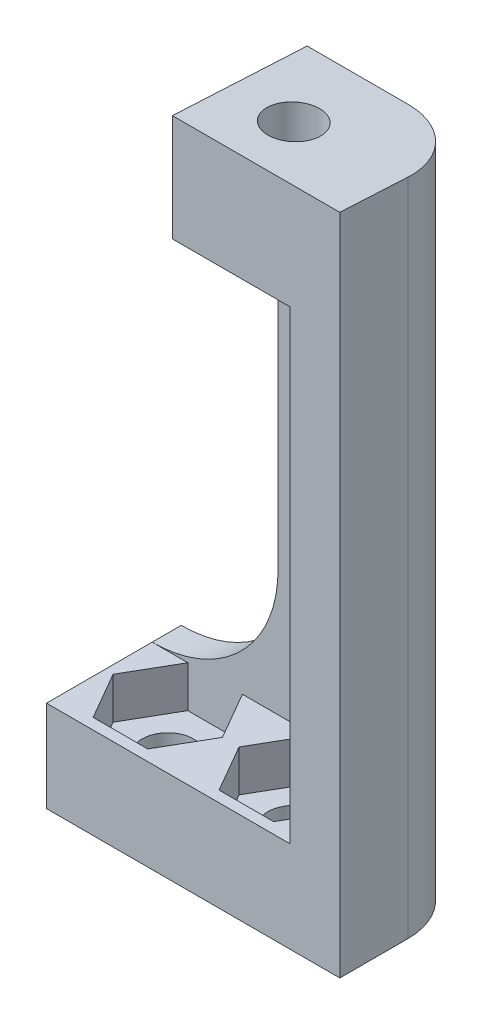
ISO-10303-21;
HEADER;
FILE_DESCRIPTION(('STEP AP214'),'2;1');
FILE_NAME('part.step','',(''),(''),'','','');
FILE_SCHEMA(('AUTOMOTIVE_DESIGN { 1 0 10303 214 1 1 1 1 }'));
ENDSEC;
DATA;
#1=APPLICATION_CONTEXT('core data for automotive mechanical design processes');
#2=APPLICATION_PROTOCOL_DEFINITION('international standard','automotive_design',2000,#1);
#3=PRODUCT_CONTEXT('',#1,'mechanical');
#4=PRODUCT('Part','Part','',(#3));
#5=PRODUCT_RELATED_PRODUCT_CATEGORY('part','',(#4));
#6=PRODUCT_DEFINITION_FORMATION('','',#4);
#7=PRODUCT_DEFINITION_CONTEXT('part definition',#1,'design');
#8=PRODUCT_DEFINITION('design','',#6,#7);
#9=PRODUCT_DEFINITION_SHAPE('','',#8);
#10=(LENGTH_UNIT() NAMED_UNIT(*) SI_UNIT(.MILLI.,.METRE.));
#11=(NAMED_UNIT(*) PLANE_ANGLE_UNIT() SI_UNIT($,.RADIAN.));
#12=(NAMED_UNIT(*) SI_UNIT($,.STERADIAN.) SOLID_ANGLE_UNIT());
#13=UNCERTAINTY_MEASURE_WITH_UNIT(LENGTH_MEASURE(1.E-05),#10,'distance_accuracy_value','');
#14=(GEOMETRIC_REPRESENTATION_CONTEXT(3) GLOBAL_UNCERTAINTY_ASSIGNED_CONTEXT((#13)) GLOBAL_UNIT_ASSIGNED_CONTEXT((#10,
#11,#12)) REPRESENTATION_CONTEXT('',''));
#15=CARTESIAN_POINT('',(0.,0.,0.));
#16=DIRECTION('',(0.,0.,1.));
#17=DIRECTION('',(1.,0.,0.));
#18=AXIS2_PLACEMENT_3D('',#15,#16,#17);
#19=CARTESIAN_POINT('',(-24.1166637724193,79.1813694194691,-120.133918355024));
#20=DIRECTION('',(0.,1.,0.));
#21=DIRECTION('',(-1.,0.,0.));
#22=AXIS2_PLACEMENT_3D('',#19,#20,#21);
#23=PLANE('',#22);
#24=DIRECTION('',(1.,0.,0.));
#25=VECTOR('',#24,1.);
#26=CARTESIAN_POINT('',(-24.1166637724193,79.1813694194691,-122.38391835524));
#27=LINE('',#26,#25);
#28=CARTESIAN_POINT('',(-32.3439051081559,79.1813694194691,-122.38391835524));
#29=VERTEX_POINT('',#28);
#30=CARTESIAN_POINT('',(-28.0530085737751,79.1813694194691,-122.38391835524));
#31=VERTEX_POINT('',#30);
#32=EDGE_CURVE('E312',#29,#31,#27,.T.);
#33=ORIENTED_EDGE('',*,*,#32,.F.);
#34=DIRECTION('',(0.5,0.,0.866025403784439));
#35=VECTOR('',#34,1.);
#36=CARTESIAN_POINT('',(28.7358623240422,79.1813694194692,-16.5906578481818));
#37=LINE('',#36,#35);
#38=CARTESIAN_POINT('',(-30.6984568409655,79.1813694194691,-119.53391835524));
#39=VERTEX_POINT('',#38);
#40=EDGE_CURVE('E316',#29,#39,#37,.T.);
#41=ORIENTED_EDGE('',*,*,#40,.T.);
#42=DIRECTION('',(-0.499999999999998,0.,0.86602540378444));
#43=VECTOR('',#42,1.);
#44=CARTESIAN_POINT('',(-74.7835475854904,79.1813694194691,-43.1763013294378));
#45=LINE('',#44,#43);
#46=CARTESIAN_POINT('',(-32.3439051081559,79.1813694194691,-116.68391835524));
#47=VERTEX_POINT('',#46);
#48=EDGE_CURVE('E340',#39,#47,#45,.T.);
#49=ORIENTED_EDGE('',*,*,#48,.T.);
#50=DIRECTION('',(-1.,0.,0.));
#51=VECTOR('',#50,1.);
#52=CARTESIAN_POINT('',(0.,79.1813694194692,-116.68391835524));
#53=LINE('',#52,#51);
#54=CARTESIAN_POINT('',(-35.6348016425368,79.1813694194691,-116.68391835524));
#55=VERTEX_POINT('',#54);
#56=EDGE_CURVE('E343',#47,#55,#53,.T.);
#57=ORIENTED_EDGE('',*,*,#56,.T.);
#58=DIRECTION('',(-0.499999999999999,0.,-0.866025403784439));
#59=VECTOR('',#58,1.);
#60=CARTESIAN_POINT('',(23.7995175224708,79.1813694194692,-13.7406578481817));
#61=LINE('',#60,#59);
#62=CARTESIAN_POINT('',(-37.2802499097272,79.1813694194691,-119.53391835524));
#63=VERTEX_POINT('',#62);
#64=EDGE_CURVE('E353',#55,#63,#61,.T.);
#65=ORIENTED_EDGE('',*,*,#64,.T.);
#66=DIRECTION('',(0.499999999999999,0.,-0.866025403784439));
#67=VECTOR('',#66,1.);
#68=CARTESIAN_POINT('',(-79.7198923870617,79.1813694194691,-46.0263013294379));
#69=LINE('',#68,#67);
#70=CARTESIAN_POINT('',(-35.6348016425368,79.1813694194691,-122.38391835524));
#71=VERTEX_POINT('',#70);
#72=EDGE_CURVE('E349',#63,#71,#69,.T.);
#73=ORIENTED_EDGE('',*,*,#72,.T.);
#74=DIRECTION('',(-1.,0.,0.));
#75=VECTOR('',#74,1.);
#76=CARTESIAN_POINT('',(0.,79.1813694194692,-122.38391835524));
#77=LINE('',#76,#75);
#78=CARTESIAN_POINT('',(-37.7802499097272,79.1813694194691,-122.38391835524));
#79=VERTEX_POINT('',#78);
#80=EDGE_CURVE('E564',#71,#79,#77,.T.);
#81=ORIENTED_EDGE('',*,*,#80,.T.);
#82=DIRECTION('',(0.,0.,1.));
#83=VECTOR('',#82,1.);
#84=CARTESIAN_POINT('',(-37.7802499097272,79.1813694194691,0.));
#85=LINE('',#84,#83);
#86=CARTESIAN_POINT('',(-37.7802499097272,79.1813694194691,-116.021026088545));
#87=VERTEX_POINT('',#86);
#88=EDGE_CURVE('E346',#79,#87,#85,.T.);
#89=ORIENTED_EDGE('',*,*,#88,.T.);
#90=DIRECTION('',(-1.,0.,0.));
#91=VECTOR('',#90,1.);
#92=CARTESIAN_POINT('',(0.,79.1813694194692,-116.021026088545));
#93=LINE('',#92,#91);
#94=CARTESIAN_POINT('',(-23.1166637722038,79.1813694194691,-116.021026088545));
#95=VERTEX_POINT('',#94);
#96=EDGE_CURVE('E490',#95,#87,#93,.T.);
#97=ORIENTED_EDGE('',*,*,#96,.F.);
#98=DIRECTION('',(0.,0.,1.));
#99=VECTOR('',#98,1.);
#100=CARTESIAN_POINT('',(-23.1166637722038,79.1813694194691,-120.133918355024));
#101=LINE('',#100,#99);
#102=CARTESIAN_POINT('',(-23.1166637722038,79.1813694194691,-119.53391835524));
#103=VERTEX_POINT('',#102);
#104=EDGE_CURVE('E323',#103,#95,#101,.T.);
#105=ORIENTED_EDGE('',*,*,#104,.F.);
#106=DIRECTION('',(-0.5,0.,0.866025403784439));
#107=VECTOR('',#106,1.);
#108=CARTESIAN_POINT('',(-69.0972027839192,79.1813694194691,-39.8932886275458));
#109=LINE('',#108,#107);
#110=CARTESIAN_POINT('',(-24.7621120393942,79.1813694194691,-116.68391835524));
#111=VERTEX_POINT('',#110);
#112=EDGE_CURVE('E461',#103,#111,#109,.T.);
#113=ORIENTED_EDGE('',*,*,#112,.T.);
#114=DIRECTION('',(-1.,0.,0.));
#115=VECTOR('',#114,1.);
#116=CARTESIAN_POINT('',(0.,79.1813694194692,-116.68391835524));
#117=LINE('',#116,#115);
#118=CARTESIAN_POINT('',(-28.0530085737751,79.1813694194691,-116.68391835524));
#119=VERTEX_POINT('',#118);
#120=EDGE_CURVE('E464',#111,#119,#117,.T.);
#121=ORIENTED_EDGE('',*,*,#120,.T.);
#122=DIRECTION('',(-0.499999999999999,0.,-0.866025403784439));
#123=VECTOR('',#122,1.);
#124=CARTESIAN_POINT('',(29.4858623240421,79.1813694194692,-17.023670550074));
#125=LINE('',#124,#123);
#126=CARTESIAN_POINT('',(-29.6984568409655,79.1813694194691,-119.53391835524));
#127=VERTEX_POINT('',#126);
#128=EDGE_CURVE('E468',#119,#127,#125,.T.);
#129=ORIENTED_EDGE('',*,*,#128,.T.);
#130=DIRECTION('',(0.5,0.,-0.866025403784438));
#131=VECTOR('',#130,1.);
#132=CARTESIAN_POINT('',(-74.0335475854905,79.1813694194691,-42.7432886275459));
#133=LINE('',#132,#131);
#134=EDGE_CURVE('E319',#127,#31,#133,.T.);
#135=ORIENTED_EDGE('',*,*,#134,.T.);
#136=EDGE_LOOP('',(#33,#41,#49,#57,#65,#73,#81,#89,#97,#105,#113,#121,#129,#135));
#137=FACE_BOUND('',#136,.T.);
#138=ADVANCED_FACE('F138',(#137),#23,.T.);
#139=CARTESIAN_POINT('',(0.,76.6813694194692,0.));
#140=DIRECTION('',(0.,1.,0.));
#141=DIRECTION('',(-1.,0.,0.));
#142=AXIS2_PLACEMENT_3D('',#139,#140,#141);
#143=PLANE('',#142);
#144=CARTESIAN_POINT('',(-33.9893533753463,76.6813694194691,-119.53391835524));
#145=DIRECTION('',(0.,1.,0.));
#146=DIRECTION('',(-1.,0.,0.));
#147=AXIS2_PLACEMENT_3D('',#144,#145,#146);
#148=CIRCLE('',#147,1.54999999999999);
#149=CARTESIAN_POINT('',(-35.5393533753463,76.6813694194691,-119.53391835524));
#150=VERTEX_POINT('',#149);
#151=EDGE_CURVE('E379',#150,#150,#148,.F.);
#152=ORIENTED_EDGE('',*,*,#151,.T.);
#153=EDGE_LOOP('',(#152));
#154=FACE_BOUND('',#153,.T.);
#155=DIRECTION('',(-1.,0.,0.));
#156=VECTOR('',#155,1.);
#157=CARTESIAN_POINT('',(0.,76.6813694194692,-116.68391835524));
#158=LINE('',#157,#156);
#159=CARTESIAN_POINT('',(-32.3439051081559,76.6813694194691,-116.68391835524));
#160=VERTEX_POINT('',#159);
#161=CARTESIAN_POINT('',(-35.6348016425368,76.6813694194691,-116.68391835524));
#162=VERTEX_POINT('',#161);
#163=EDGE_CURVE('E371',#160,#162,#158,.T.);
#164=ORIENTED_EDGE('',*,*,#163,.F.);
#165=DIRECTION('',(-0.499999999999998,0.,0.86602540378444));
#166=VECTOR('',#165,1.);
#167=CARTESIAN_POINT('',(-74.7835475854904,76.6813694194691,-43.1763013294378));
#168=LINE('',#167,#166);
#169=CARTESIAN_POINT('',(-30.6984568409655,76.6813694194691,-119.53391835524));
#170=VERTEX_POINT('',#169);
#171=EDGE_CURVE('E335',#170,#160,#168,.T.);
#172=ORIENTED_EDGE('',*,*,#171,.F.);
#173=DIRECTION('',(0.5,0.,0.866025403784439));
#174=VECTOR('',#173,1.);
#175=CARTESIAN_POINT('',(28.7358623240422,76.6813694194692,-16.5906578481818));
#176=LINE('',#175,#174);
#177=CARTESIAN_POINT('',(-32.3439051081559,76.6813694194691,-122.38391835524));
#178=VERTEX_POINT('',#177);
#179=EDGE_CURVE('E334',#178,#170,#176,.T.);
#180=ORIENTED_EDGE('',*,*,#179,.F.);
#181=DIRECTION('',(1.,0.,0.));
#182=VECTOR('',#181,1.);
#183=CARTESIAN_POINT('',(0.,76.6813694194692,-122.38391835524));
#184=LINE('',#183,#182);
#185=CARTESIAN_POINT('',(-35.6348016425368,76.6813694194691,-122.38391835524));
#186=VERTEX_POINT('',#185);
#187=EDGE_CURVE('E330',#186,#178,#184,.T.);
#188=ORIENTED_EDGE('',*,*,#187,.F.);
#189=DIRECTION('',(0.499999999999999,0.,-0.866025403784439));
#190=VECTOR('',#189,1.);
#191=CARTESIAN_POINT('',(-79.7198923870617,76.6813694194691,-46.0263013294379));
#192=LINE('',#191,#190);
#193=CARTESIAN_POINT('',(-37.2802499097272,76.6813694194691,-119.53391835524));
#194=VERTEX_POINT('',#193);
#195=EDGE_CURVE('E364',#194,#186,#192,.T.);
#196=ORIENTED_EDGE('',*,*,#195,.F.);
#197=DIRECTION('',(-0.499999999999999,0.,-0.866025403784439));
#198=VECTOR('',#197,1.);
#199=CARTESIAN_POINT('',(23.7995175224708,76.6813694194692,-13.7406578481817));
#200=LINE('',#199,#198);
#201=EDGE_CURVE('E367',#162,#194,#200,.T.);
#202=ORIENTED_EDGE('',*,*,#201,.F.);
#203=EDGE_LOOP('',(#164,#172,#180,#188,#196,#202));
#204=FACE_BOUND('',#203,.T.);
#205=ADVANCED_FACE('F587',(#154,#204),#143,.T.);
#206=CARTESIAN_POINT('',(-23.1166637722038,126.341091322669,-120.133918355024));
#207=DIRECTION('',(1.,0.,0.));
#208=DIRECTION('',(0.,1.,0.));
#209=AXIS2_PLACEMENT_3D('',#206,#207,#208);
#210=PLANE('',#209);
#211=DIRECTION('',(0.,0.,1.));
#212=VECTOR('',#211,1.);
#213=CARTESIAN_POINT('',(-23.1166637722038,107.17861732389,-120.133918355024));
#214=LINE('',#213,#212);
#215=CARTESIAN_POINT('',(-23.1166637722038,107.17861732389,-119.53391835524));
#216=VERTEX_POINT('',#215);
#217=CARTESIAN_POINT('',(-23.1166637722038,107.17861732389,-116.021026088545));
#218=VERTEX_POINT('',#217);
#219=EDGE_CURVE('E421',#216,#218,#214,.T.);
#220=ORIENTED_EDGE('',*,*,#219,.F.);
#221=DIRECTION('',(0.,-1.,0.));
#222=VECTOR('',#221,1.);
#223=CARTESIAN_POINT('',(-23.1166637722038,126.341091322669,-119.53391835524));
#224=LINE('',#223,#222);
#225=EDGE_CURVE('E459',#216,#103,#224,.T.);
#226=ORIENTED_EDGE('',*,*,#225,.T.);
#227=ORIENTED_EDGE('',*,*,#104,.T.);
#228=DIRECTION('',(0.,-1.,0.));
#229=VECTOR('',#228,1.);
#230=CARTESIAN_POINT('',(-23.1166637722038,126.341091322669,-116.021026088545));
#231=LINE('',#230,#229);
#232=EDGE_CURVE('E322',#218,#95,#231,.T.);
#233=ORIENTED_EDGE('',*,*,#232,.F.);
#234=EDGE_LOOP('',(#220,#226,#227,#233));
#235=FACE_BOUND('',#234,.T.);
#236=ADVANCED_FACE('F609',(#235),#210,.F.);
#237=CARTESIAN_POINT('',(0.,79.1813694194692,-122.38391835524));
#238=DIRECTION('',(0.,0.,-1.));
#239=DIRECTION('',(0.,1.,0.));
#240=AXIS2_PLACEMENT_3D('',#237,#238,#239);
#241=PLANE('',#240);
#242=DIRECTION('',(0.,1.,0.));
#243=VECTOR('',#242,1.);
#244=CARTESIAN_POINT('',(-28.0530085737751,107.17861732389,-122.38391835524));
#245=LINE('',#244,#243);
#246=CARTESIAN_POINT('',(-28.0530085737751,107.17861732389,-122.38391835524));
#247=VERTEX_POINT('',#246);
#248=CARTESIAN_POINT('',(-28.0530085737751,110.17861732389,-122.38391835524));
#249=VERTEX_POINT('',#248);
#250=EDGE_CURVE('E398',#247,#249,#245,.T.);
#251=ORIENTED_EDGE('',*,*,#250,.F.);
#252=DIRECTION('',(1.,0.,0.));
#253=VECTOR('',#252,1.);
#254=CARTESIAN_POINT('',(-1.12559643690961E-13,107.17861732389,-122.38391835524));
#255=LINE('',#254,#253);
#256=CARTESIAN_POINT('',(-30.1984568409655,107.17861732389,-122.38391835524));
#257=VERTEX_POINT('',#256);
#258=EDGE_CURVE('E423',#257,#247,#255,.T.);
#259=ORIENTED_EDGE('',*,*,#258,.F.);
#260=DIRECTION('',(0.,-1.,0.));
#261=VECTOR('',#260,1.);
#262=CARTESIAN_POINT('',(-30.1984568409655,126.341091322669,-122.38391835524));
#263=LINE('',#262,#261);
#264=CARTESIAN_POINT('',(-30.1984568409655,86.7631624882309,-122.38391835524));
#265=VERTEX_POINT('',#264);
#266=EDGE_CURVE('E454',#257,#265,#263,.T.);
#267=ORIENTED_EDGE('',*,*,#266,.T.);
#268=CARTESIAN_POINT('',(-37.7802499097274,86.7631624882309,-122.38391835524));
#269=DIRECTION('',(0.,0.,-1.));
#270=DIRECTION('',(0.,1.,0.));
#271=AXIS2_PLACEMENT_3D('',#268,#269,#270);
#272=CIRCLE('',#271,7.58179306876172);
#273=EDGE_CURVE('E358',#265,#79,#272,.T.);
#274=ORIENTED_EDGE('',*,*,#273,.T.);
#275=ORIENTED_EDGE('',*,*,#80,.F.);
#276=DIRECTION('',(0.,-1.,0.));
#277=VECTOR('',#276,1.);
#278=CARTESIAN_POINT('',(-35.6348016425368,90.285540125493,-122.38391835524));
#279=LINE('',#278,#277);
#280=EDGE_CURVE('E360',#71,#186,#279,.T.);
#281=ORIENTED_EDGE('',*,*,#280,.T.);
#282=ORIENTED_EDGE('',*,*,#187,.T.);
#283=DIRECTION('',(0.,-1.,0.));
#284=VECTOR('',#283,1.);
#285=CARTESIAN_POINT('',(-32.343905108156,90.285540125493,-122.38391835524));
#286=LINE('',#285,#284);
#287=EDGE_CURVE('E326',#29,#178,#286,.T.);
#288=ORIENTED_EDGE('',*,*,#287,.F.);
#289=ORIENTED_EDGE('',*,*,#32,.T.);
#290=DIRECTION('',(0.,-1.,0.));
#291=VECTOR('',#290,1.);
#292=CARTESIAN_POINT('',(-28.0530085737751,79.1813694194691,-122.38391835524));
#293=LINE('',#292,#291);
#294=CARTESIAN_POINT('',(-28.0530085737751,76.6813694194691,-122.38391835524));
#295=VERTEX_POINT('',#294);
#296=EDGE_CURVE('E488',#31,#295,#293,.T.);
#297=ORIENTED_EDGE('',*,*,#296,.T.);
#298=DIRECTION('',(1.,0.,0.));
#299=VECTOR('',#298,1.);
#300=CARTESIAN_POINT('',(0.,76.6813694194692,-122.38391835524));
#301=LINE('',#300,#299);
#302=CARTESIAN_POINT('',(-24.7621120393942,76.6813694194691,-122.38391835524));
#303=VERTEX_POINT('',#302);
#304=EDGE_CURVE('E456',#295,#303,#301,.T.);
#305=ORIENTED_EDGE('',*,*,#304,.T.);
#306=DIRECTION('',(0.,-1.,0.));
#307=VECTOR('',#306,1.);
#308=CARTESIAN_POINT('',(-24.7621120393942,79.1813694194692,-122.38391835524));
#309=LINE('',#308,#307);
#310=CARTESIAN_POINT('',(-24.7621120393942,110.17861732389,-122.38391835524));
#311=VERTEX_POINT('',#310);
#312=EDGE_CURVE('E471',#311,#303,#309,.T.);
#313=ORIENTED_EDGE('',*,*,#312,.F.);
#314=DIRECTION('',(1.,0.,0.));
#315=VECTOR('',#314,1.);
#316=CARTESIAN_POINT('',(-1.15706425441358E-13,110.17861732389,-122.38391835524));
#317=LINE('',#316,#315);
#318=EDGE_CURVE('E450',#249,#311,#317,.T.);
#319=ORIENTED_EDGE('',*,*,#318,.F.);
#320=EDGE_LOOP('',(#251,#259,#267,#274,#275,#281,#282,#288,#289,#297,#305,#313,#319));
#321=FACE_BOUND('',#320,.T.);
#322=ADVANCED_FACE('F328',(#321),#241,.F.);
#323=CARTESIAN_POINT('',(34.4222071256135,79.1813694194692,-19.873670550074));
#324=DIRECTION('',(0.866025403784439,0.,-0.5));
#325=DIRECTION('',(-0.5,0.,-0.866025403784439));
#326=AXIS2_PLACEMENT_3D('',#323,#324,#325);
#327=PLANE('',#326);
#328=ORIENTED_EDGE('',*,*,#312,.T.);
#329=DIRECTION('',(0.5,0.,0.866025403784439));
#330=VECTOR('',#329,1.);
#331=CARTESIAN_POINT('',(34.4222071256135,76.6813694194692,-19.873670550074));
#332=LINE('',#331,#330);
#333=CARTESIAN_POINT('',(-23.1166637722038,76.6813694194691,-119.53391835524));
#334=VERTEX_POINT('',#333);
#335=EDGE_CURVE('E474',#303,#334,#332,.T.);
#336=ORIENTED_EDGE('',*,*,#335,.T.);
#337=DIRECTION('',(0.,-1.,0.));
#338=VECTOR('',#337,1.);
#339=CARTESIAN_POINT('',(-23.1166637722038,79.1813694194691,-119.53391835524));
#340=LINE('',#339,#338);
#341=EDGE_CURVE('E500',#103,#334,#340,.T.);
#342=ORIENTED_EDGE('',*,*,#341,.F.);
#343=ORIENTED_EDGE('',*,*,#225,.F.);
#344=CARTESIAN_POINT('',(-23.1166637722038,110.17861732389,-119.53391835524));
#345=VERTEX_POINT('',#344);
#346=EDGE_CURVE('E457',#345,#216,#224,.T.);
#347=ORIENTED_EDGE('',*,*,#346,.F.);
#348=DIRECTION('',(0.5,0.,0.866025403784439));
#349=VECTOR('',#348,1.);
#350=CARTESIAN_POINT('',(34.4222071256134,110.17861732389,-19.873670550074));
#351=LINE('',#350,#349);
#352=EDGE_CURVE('E429',#311,#345,#351,.T.);
#353=ORIENTED_EDGE('',*,*,#352,.F.);
#354=EDGE_LOOP('',(#328,#336,#342,#343,#347,#353));
#355=FACE_BOUND('',#354,.T.);
#356=ADVANCED_FACE('F635',(#355),#327,.F.);
#357=CARTESIAN_POINT('',(-2.27378027267794E-13,76.6813694194692,-124.13391835524));
#358=DIRECTION('',(0.,0.,1.));
#359=DIRECTION('',(1.,0.,0.));
#360=AXIS2_PLACEMENT_3D('',#357,#358,#359);
#361=PLANE('',#360);
#362=CARTESIAN_POINT('',(-37.7802499097274,86.7631624882309,-124.13391835524));
#363=DIRECTION('',(0.,0.,-1.));
#364=DIRECTION('',(-1.,0.,0.));
#365=AXIS2_PLACEMENT_3D('',#362,#363,#364);
#366=CIRCLE('',#365,7.58179306876172);
#367=CARTESIAN_POINT('',(-37.7802499097272,79.1813694194691,-124.13391835524));
#368=VERTEX_POINT('',#367);
#369=CARTESIAN_POINT('',(-30.1984568409655,86.7631624882309,-124.13391835524));
#370=VERTEX_POINT('',#369);
#371=EDGE_CURVE('E641',#368,#370,#366,.F.);
#372=ORIENTED_EDGE('',*,*,#371,.T.);
#373=DIRECTION('',(0.,-1.,0.));
#374=VECTOR('',#373,1.);
#375=CARTESIAN_POINT('',(-30.1984568409655,76.6813694194691,-124.13391835524));
#376=LINE('',#375,#374);
#377=CARTESIAN_POINT('',(-30.1984568409656,113.182745467259,-124.13391835524));
#378=VERTEX_POINT('',#377);
#379=EDGE_CURVE('E13',#378,#370,#376,.T.);
#380=ORIENTED_EDGE('',*,*,#379,.F.);
#381=DIRECTION('',(1.,0.,0.));
#382=VECTOR('',#381,1.);
#383=CARTESIAN_POINT('',(-2.65343423438565E-13,113.182745467259,-124.13391835524));
#384=LINE('',#383,#382);
#385=CARTESIAN_POINT('',(-24.1166637724193,113.182745467259,-124.13391835524));
#386=VERTEX_POINT('',#385);
#387=EDGE_CURVE('E440',#378,#386,#384,.T.);
#388=ORIENTED_EDGE('',*,*,#387,.T.);
#389=DIRECTION('',(0.,-1.,0.));
#390=VECTOR('',#389,1.);
#391=CARTESIAN_POINT('',(-24.1166637724193,76.6813694194691,-124.13391835524));
#392=LINE('',#391,#390);
#393=CARTESIAN_POINT('',(-24.1166637724193,73.6813694194691,-124.13391835524));
#394=VERTEX_POINT('',#393);
#395=EDGE_CURVE('E510',#386,#394,#392,.T.);
#396=ORIENTED_EDGE('',*,*,#395,.T.);
#397=DIRECTION('',(-1.,0.,0.));
#398=VECTOR('',#397,1.);
#399=CARTESIAN_POINT('',(-2.24156479327355E-13,73.6813694194692,-124.13391835524));
#400=LINE('',#399,#398);
#401=CARTESIAN_POINT('',(-37.7802499097272,73.6813694194691,-124.13391835524));
#402=VERTEX_POINT('',#401);
#403=EDGE_CURVE('E506',#394,#402,#400,.T.);
#404=ORIENTED_EDGE('',*,*,#403,.T.);
#405=DIRECTION('',(0.,-1.,0.));
#406=VECTOR('',#405,1.);
#407=CARTESIAN_POINT('',(-37.7802499097273,87.785540125493,-124.13391835524));
#408=LINE('',#407,#406);
#409=EDGE_CURVE('E352',#368,#402,#408,.T.);
#410=ORIENTED_EDGE('',*,*,#409,.F.);
#411=EDGE_LOOP('',(#372,#380,#388,#396,#404,#410));
#412=FACE_BOUND('',#411,.T.);
#413=ADVANCED_FACE('F140',(#412),#361,.F.);
#414=CARTESIAN_POINT('',(-30.1984568409653,76.6813694194691,0.));
#415=DIRECTION('',(1.,0.,0.));
#416=DIRECTION('',(0.,0.,-1.));
#417=AXIS2_PLACEMENT_3D('',#414,#415,#416);
#418=PLANE('',#417);
#419=ORIENTED_EDGE('',*,*,#379,.T.);
#420=DIRECTION('',(0.,0.,-1.));
#421=VECTOR('',#420,1.);
#422=CARTESIAN_POINT('',(-30.1984568409655,86.7631624882309,-111.661643770291));
#423=LINE('',#422,#421);
#424=EDGE_CURVE('E152',#265,#370,#423,.T.);
#425=ORIENTED_EDGE('',*,*,#424,.F.);
#426=ORIENTED_EDGE('',*,*,#266,.F.);
#427=DIRECTION('',(0.,0.,-1.));
#428=VECTOR('',#427,1.);
#429=CARTESIAN_POINT('',(-30.1984568409653,107.17861732389,0.));
#430=LINE('',#429,#428);
#431=CARTESIAN_POINT('',(-30.1984568409655,107.17861732389,-116.021026088545));
#432=VERTEX_POINT('',#431);
#433=EDGE_CURVE('E416',#432,#257,#430,.T.);
#434=ORIENTED_EDGE('',*,*,#433,.F.);
#435=DIRECTION('',(0.,-1.,0.));
#436=VECTOR('',#435,1.);
#437=CARTESIAN_POINT('',(-30.1984568409655,126.345219466038,-116.021026088545));
#438=LINE('',#437,#436);
#439=CARTESIAN_POINT('',(-30.1984568409655,113.608497584531,-116.021026088545));
#440=VERTEX_POINT('',#439);
#441=EDGE_CURVE('E438',#440,#432,#438,.T.);
#442=ORIENTED_EDGE('',*,*,#441,.F.);
#443=DIRECTION('',(0.,-0.0524063494365438,-0.998625843115796));
#444=VECTOR('',#443,1.);
#445=CARTESIAN_POINT('',(-30.1984568409653,119.715361275479,0.347924768264701));
#446=LINE('',#445,#444);
#447=EDGE_CURVE('E430',#440,#378,#446,.T.);
#448=ORIENTED_EDGE('',*,*,#447,.T.);
#449=EDGE_LOOP('',(#419,#425,#426,#434,#442,#448));
#450=FACE_BOUND('',#449,.T.);
#451=ADVANCED_FACE('F555',(#450),#418,.F.);
#452=CARTESIAN_POINT('',(0.,76.6813694194692,-116.021026088545));
#453=DIRECTION('',(0.,0.,-1.));
#454=DIRECTION('',(0.,1.,0.));
#455=AXIS2_PLACEMENT_3D('',#452,#453,#454);
#456=PLANE('',#455);
#457=DIRECTION('',(-1.,0.,0.));
#458=VECTOR('',#457,1.);
#459=CARTESIAN_POINT('',(-1.12228764742212E-13,107.17861732389,-116.021026088545));
#460=LINE('',#459,#458);
#461=EDGE_CURVE('E418',#218,#432,#460,.T.);
#462=ORIENTED_EDGE('',*,*,#461,.F.);
#463=ORIENTED_EDGE('',*,*,#232,.T.);
#464=ORIENTED_EDGE('',*,*,#96,.T.);
#465=DIRECTION('',(0.,-1.,0.));
#466=VECTOR('',#465,1.);
#467=CARTESIAN_POINT('',(-37.7802499097273,87.785540125493,-116.021026088545));
#468=LINE('',#467,#466);
#469=CARTESIAN_POINT('',(-37.7802499097272,73.6813694194691,-116.021026088545));
#470=VERTEX_POINT('',#469);
#471=EDGE_CURVE('E376',#87,#470,#468,.T.);
#472=ORIENTED_EDGE('',*,*,#471,.T.);
#473=DIRECTION('',(1.,0.,0.));
#474=VECTOR('',#473,1.);
#475=CARTESIAN_POINT('',(0.,73.6813694194692,-116.021026088545));
#476=LINE('',#475,#474);
#477=CARTESIAN_POINT('',(-20.1166637722038,73.6813694194691,-116.021026088545));
#478=VERTEX_POINT('',#477);
#479=EDGE_CURVE('E513',#470,#478,#476,.T.);
#480=ORIENTED_EDGE('',*,*,#479,.T.);
#481=DIRECTION('',(0.,-1.,0.));
#482=VECTOR('',#481,1.);
#483=CARTESIAN_POINT('',(-20.1166637722038,76.6813694194691,-116.021026088545));
#484=LINE('',#483,#482);
#485=CARTESIAN_POINT('',(-20.1166637722038,113.608497584531,-116.021026088545));
#486=VERTEX_POINT('',#485);
#487=EDGE_CURVE('E146',#486,#478,#484,.T.);
#488=ORIENTED_EDGE('',*,*,#487,.F.);
#489=DIRECTION('',(-1.,0.,0.));
#490=VECTOR('',#489,1.);
#491=CARTESIAN_POINT('',(-1.18146271355891E-13,113.608497584531,-116.021026088545));
#492=LINE('',#491,#490);
#493=EDGE_CURVE('E431',#486,#440,#492,.T.);
#494=ORIENTED_EDGE('',*,*,#493,.T.);
#495=ORIENTED_EDGE('',*,*,#441,.T.);
#496=EDGE_LOOP('',(#462,#463,#464,#472,#480,#488,#494,#495));
#497=FACE_BOUND('',#496,.T.);
#498=ADVANCED_FACE('F534',(#497),#456,.F.);
#499=CARTESIAN_POINT('',(-20.1166637722036,76.6813694194691,0.));
#500=DIRECTION('',(-1.,0.,0.));
#501=DIRECTION('',(0.,0.,1.));
#502=AXIS2_PLACEMENT_3D('',#499,#500,#501);
#503=PLANE('',#502);
#504=ORIENTED_EDGE('',*,*,#487,.T.);
#505=DIRECTION('',(0.,0.,-1.));
#506=VECTOR('',#505,1.);
#507=CARTESIAN_POINT('',(-20.1166637722036,73.6813694194691,0.));
#508=LINE('',#507,#506);
#509=CARTESIAN_POINT('',(-20.1166637722038,73.6813694194691,-120.133918355024));
#510=VERTEX_POINT('',#509);
#511=EDGE_CURVE('E516',#478,#510,#508,.T.);
#512=ORIENTED_EDGE('',*,*,#511,.T.);
#513=DIRECTION('',(0.,-1.,0.));
#514=VECTOR('',#513,1.);
#515=CARTESIAN_POINT('',(-20.1166637722038,76.6813694194691,-120.133918355024));
#516=LINE('',#515,#514);
#517=CARTESIAN_POINT('',(-20.1166637722032,113.392659319581,-120.133918355027));
#518=VERTEX_POINT('',#517);
#519=EDGE_CURVE('E525',#518,#510,#516,.T.);
#520=ORIENTED_EDGE('',*,*,#519,.F.);
#521=DIRECTION('',(0.,0.0524063494365438,0.998625843115796));
#522=VECTOR('',#521,1.);
#523=CARTESIAN_POINT('',(-20.1166637722037,119.715361275479,0.347924768264673));
#524=LINE('',#523,#522);
#525=EDGE_CURVE('E434',#518,#486,#524,.T.);
#526=ORIENTED_EDGE('',*,*,#525,.T.);
#527=EDGE_LOOP('',(#504,#512,#520,#526));
#528=FACE_BOUND('',#527,.T.);
#529=ADVANCED_FACE('F527',(#528),#503,.F.);
#530=CARTESIAN_POINT('',(-24.1166637724193,76.6813694194691,-120.133918355024));
#531=DIRECTION('',(0.,-1.,0.));
#532=DIRECTION('',(1.,0.,0.));
#533=AXIS2_PLACEMENT_3D('',#530,#531,#532);
#534=CYLINDRICAL_SURFACE('',#533,4.00000000021555);
#535=ORIENTED_EDGE('',*,*,#519,.T.);
#536=CARTESIAN_POINT('',(-24.1166637724193,73.6813694194691,-120.133918355024));
#537=DIRECTION('',(0.,1.,0.));
#538=DIRECTION('',(-1.,0.,0.));
#539=AXIS2_PLACEMENT_3D('',#536,#537,#538);
#540=CIRCLE('',#539,4.00000000021555);
#541=EDGE_CURVE('E519',#510,#394,#540,.T.);
#542=ORIENTED_EDGE('',*,*,#541,.T.);
#543=ORIENTED_EDGE('',*,*,#395,.F.);
#544=CARTESIAN_POINT('',(-24.1166637724193,113.392659319582,-120.133918355024));
#545=DIRECTION('',(0.,-0.998625843115796,0.0524063494365438));
#546=DIRECTION('',(0.,-0.0524063494365438,-0.998625843115796));
#547=AXIS2_PLACEMENT_3D('',#544,#545,#546);
#548=ELLIPSE('',#547,4.00550419137484,4.00000000021555);
#549=EDGE_CURVE('E443',#386,#518,#548,.T.);
#550=ORIENTED_EDGE('',*,*,#549,.T.);
#551=EDGE_LOOP('',(#535,#542,#543,#550));
#552=FACE_BOUND('',#551,.T.);
#553=ADVANCED_FACE('F542',(#552),#534,.T.);
#554=CARTESIAN_POINT('',(-26.4075603065846,76.6813694194691,-119.53391835524));
#555=DIRECTION('',(0.,-1.,0.));
#556=DIRECTION('',(1.,0.,0.));
#557=AXIS2_PLACEMENT_3D('',#554,#555,#556);
#558=CYLINDRICAL_SURFACE('',#557,1.54999999999999);
#559=CARTESIAN_POINT('',(-26.4075603065846,76.6813694194691,-119.53391835524));
#560=DIRECTION('',(0.,1.,0.));
#561=DIRECTION('',(-1.,0.,0.));
#562=AXIS2_PLACEMENT_3D('',#559,#560,#561);
#563=CIRCLE('',#562,1.54999999999999);
#564=CARTESIAN_POINT('',(-27.9575603065846,76.6813694194691,-119.53391835524));
#565=VERTEX_POINT('',#564);
#566=EDGE_CURVE('E507',#565,#565,#563,.F.);
#567=ORIENTED_EDGE('',*,*,#566,.F.);
#568=EDGE_LOOP('',(#567));
#569=FACE_BOUND('',#568,.T.);
#570=CARTESIAN_POINT('',(-26.4075603065846,73.6813694194691,-119.53391835524));
#571=DIRECTION('',(0.,1.,0.));
#572=DIRECTION('',(-1.,0.,0.));
#573=AXIS2_PLACEMENT_3D('',#570,#571,#572);
#574=CIRCLE('',#573,1.54999999999999);
#575=CARTESIAN_POINT('',(-27.9575603065846,73.6813694194691,-119.53391835524));
#576=VERTEX_POINT('',#575);
#577=EDGE_CURVE('E511',#576,#576,#574,.F.);
#578=ORIENTED_EDGE('',*,*,#577,.T.);
#579=EDGE_LOOP('',(#578));
#580=FACE_BOUND('',#579,.T.);
#581=ADVANCED_FACE('F618',(#569,#580),#558,.F.);
#582=CARTESIAN_POINT('',(0.,76.6813694194692,0.));
#583=DIRECTION('',(0.,1.,0.));
#584=DIRECTION('',(-1.,0.,0.));
#585=AXIS2_PLACEMENT_3D('',#582,#583,#584);
#586=PLANE('',#585);
#587=ORIENTED_EDGE('',*,*,#335,.F.);
#588=ORIENTED_EDGE('',*,*,#304,.F.);
#589=DIRECTION('',(0.5,0.,-0.866025403784438));
#590=VECTOR('',#589,1.);
#591=CARTESIAN_POINT('',(-74.0335475854905,76.6813694194691,-42.7432886275459));
#592=LINE('',#591,#590);
#593=CARTESIAN_POINT('',(-29.6984568409655,76.6813694194691,-119.53391835524));
#594=VERTEX_POINT('',#593);
#595=EDGE_CURVE('E465',#594,#295,#592,.T.);
#596=ORIENTED_EDGE('',*,*,#595,.F.);
#597=DIRECTION('',(-0.499999999999999,0.,-0.866025403784439));
#598=VECTOR('',#597,1.);
#599=CARTESIAN_POINT('',(29.4858623240421,76.6813694194692,-17.023670550074));
#600=LINE('',#599,#598);
#601=CARTESIAN_POINT('',(-28.0530085737751,76.6813694194691,-116.68391835524));
#602=VERTEX_POINT('',#601);
#603=EDGE_CURVE('E483',#602,#594,#600,.T.);
#604=ORIENTED_EDGE('',*,*,#603,.F.);
#605=DIRECTION('',(-1.,0.,0.));
#606=VECTOR('',#605,1.);
#607=CARTESIAN_POINT('',(0.,76.6813694194692,-116.68391835524));
#608=LINE('',#607,#606);
#609=CARTESIAN_POINT('',(-24.7621120393942,76.6813694194691,-116.68391835524));
#610=VERTEX_POINT('',#609);
#611=EDGE_CURVE('E480',#610,#602,#608,.T.);
#612=ORIENTED_EDGE('',*,*,#611,.F.);
#613=DIRECTION('',(-0.5,0.,0.866025403784439));
#614=VECTOR('',#613,1.);
#615=CARTESIAN_POINT('',(-69.0972027839192,76.6813694194691,-39.8932886275458));
#616=LINE('',#615,#614);
#617=EDGE_CURVE('E477',#334,#610,#616,.T.);
#618=ORIENTED_EDGE('',*,*,#617,.F.);
#619=EDGE_LOOP('',(#587,#588,#596,#604,#612,#618));
#620=FACE_BOUND('',#619,.T.);
#621=ORIENTED_EDGE('',*,*,#566,.T.);
#622=EDGE_LOOP('',(#621));
#623=FACE_BOUND('',#622,.T.);
#624=ADVANCED_FACE('F615',(#620,#623),#586,.T.);
#625=CARTESIAN_POINT('',(0.,73.6813694194692,0.));
#626=DIRECTION('',(0.,1.,0.));
#627=DIRECTION('',(-1.,0.,0.));
#628=AXIS2_PLACEMENT_3D('',#625,#626,#627);
#629=PLANE('',#628);
#630=ORIENTED_EDGE('',*,*,#403,.F.);
#631=ORIENTED_EDGE('',*,*,#541,.F.);
#632=ORIENTED_EDGE('',*,*,#511,.F.);
#633=ORIENTED_EDGE('',*,*,#479,.F.);
#634=DIRECTION('',(0.,0.,-1.));
#635=VECTOR('',#634,1.);
#636=CARTESIAN_POINT('',(-37.7802499097272,73.6813694194691,0.));
#637=LINE('',#636,#635);
#638=EDGE_CURVE('E375',#470,#402,#637,.T.);
#639=ORIENTED_EDGE('',*,*,#638,.T.);
#640=EDGE_LOOP('',(#630,#631,#632,#633,#639));
#641=FACE_BOUND('',#640,.T.);
#642=ORIENTED_EDGE('',*,*,#577,.F.);
#643=EDGE_LOOP('',(#642));
#644=FACE_BOUND('',#643,.T.);
#645=CARTESIAN_POINT('',(-33.9893533753463,73.6813694194691,-119.53391835524));
#646=DIRECTION('',(0.,1.,0.));
#647=DIRECTION('',(-1.,0.,0.));
#648=AXIS2_PLACEMENT_3D('',#645,#646,#647);
#649=CIRCLE('',#648,1.54999999999999);
#650=CARTESIAN_POINT('',(-35.5393533753463,73.6813694194691,-119.53391835524));
#651=VERTEX_POINT('',#650);
#652=EDGE_CURVE('E372',#651,#651,#649,.F.);
#653=ORIENTED_EDGE('',*,*,#652,.F.);
#654=EDGE_LOOP('',(#653));
#655=FACE_BOUND('',#654,.T.);
#656=ADVANCED_FACE('F539',(#641,#644,#655),#629,.F.);
#657=CARTESIAN_POINT('',(-74.0335475854905,79.1813694194691,-42.7432886275459));
#658=DIRECTION('',(-0.866025403784439,0.,-0.5));
#659=DIRECTION('',(-0.5,0.,0.866025403784439));
#660=AXIS2_PLACEMENT_3D('',#657,#658,#659);
#661=PLANE('',#660);
#662=ORIENTED_EDGE('',*,*,#595,.T.);
#663=ORIENTED_EDGE('',*,*,#296,.F.);
#664=ORIENTED_EDGE('',*,*,#134,.F.);
#665=DIRECTION('',(0.,-1.,0.));
#666=VECTOR('',#665,1.);
#667=CARTESIAN_POINT('',(-29.6984568409655,79.1813694194691,-119.53391835524));
#668=LINE('',#667,#666);
#669=EDGE_CURVE('E491',#127,#594,#668,.T.);
#670=ORIENTED_EDGE('',*,*,#669,.T.);
#671=EDGE_LOOP('',(#662,#663,#664,#670));
#672=FACE_BOUND('',#671,.T.);
#673=ADVANCED_FACE('F622',(#672),#661,.F.);
#674=CARTESIAN_POINT('',(29.4858623240421,79.1813694194692,-17.023670550074));
#675=DIRECTION('',(-0.866025403784439,0.,0.499999999999999));
#676=DIRECTION('',(0.499999999999999,0.,0.866025403784439));
#677=AXIS2_PLACEMENT_3D('',#674,#675,#676);
#678=PLANE('',#677);
#679=ORIENTED_EDGE('',*,*,#603,.T.);
#680=ORIENTED_EDGE('',*,*,#669,.F.);
#681=ORIENTED_EDGE('',*,*,#128,.F.);
#682=DIRECTION('',(0.,-1.,0.));
#683=VECTOR('',#682,1.);
#684=CARTESIAN_POINT('',(-28.0530085737751,79.1813694194691,-116.68391835524));
#685=LINE('',#684,#683);
#686=EDGE_CURVE('E494',#119,#602,#685,.T.);
#687=ORIENTED_EDGE('',*,*,#686,.T.);
#688=EDGE_LOOP('',(#679,#680,#681,#687));
#689=FACE_BOUND('',#688,.T.);
#690=ADVANCED_FACE('F662',(#689),#678,.F.);
#691=CARTESIAN_POINT('',(0.,79.1813694194692,-116.68391835524));
#692=DIRECTION('',(0.,0.,1.));
#693=DIRECTION('',(0.,-1.,0.));
#694=AXIS2_PLACEMENT_3D('',#691,#692,#693);
#695=PLANE('',#694);
#696=ORIENTED_EDGE('',*,*,#611,.T.);
#697=ORIENTED_EDGE('',*,*,#686,.F.);
#698=ORIENTED_EDGE('',*,*,#120,.F.);
#699=DIRECTION('',(0.,-1.,0.));
#700=VECTOR('',#699,1.);
#701=CARTESIAN_POINT('',(-24.7621120393942,79.1813694194691,-116.68391835524));
#702=LINE('',#701,#700);
#703=EDGE_CURVE('E497',#111,#610,#702,.T.);
#704=ORIENTED_EDGE('',*,*,#703,.T.);
#705=EDGE_LOOP('',(#696,#697,#698,#704));
#706=FACE_BOUND('',#705,.T.);
#707=ADVANCED_FACE('F664',(#706),#695,.F.);
#708=CARTESIAN_POINT('',(-69.0972027839192,79.1813694194691,-39.8932886275458));
#709=DIRECTION('',(0.866025403784439,0.,0.5));
#710=DIRECTION('',(0.5,0.,-0.866025403784439));
#711=AXIS2_PLACEMENT_3D('',#708,#709,#710);
#712=PLANE('',#711);
#713=ORIENTED_EDGE('',*,*,#617,.T.);
#714=ORIENTED_EDGE('',*,*,#703,.F.);
#715=ORIENTED_EDGE('',*,*,#112,.F.);
#716=ORIENTED_EDGE('',*,*,#341,.T.);
#717=EDGE_LOOP('',(#713,#714,#715,#716));
#718=FACE_BOUND('',#717,.T.);
#719=ADVANCED_FACE('F651',(#718),#712,.F.);
#720=CARTESIAN_POINT('',(-1.15450312682651E-13,110.17861732389,0.));
#721=DIRECTION('',(0.,1.,0.));
#722=DIRECTION('',(-1.,0.,0.));
#723=AXIS2_PLACEMENT_3D('',#720,#721,#722);
#724=PLANE('',#723);
#725=CARTESIAN_POINT('',(-26.4075603065847,110.17861732389,-119.53391835524));
#726=DIRECTION('',(0.,1.,0.));
#727=DIRECTION('',(-1.,0.,0.));
#728=AXIS2_PLACEMENT_3D('',#725,#726,#727);
#729=CIRCLE('',#728,1.54999999999999);
#730=CARTESIAN_POINT('',(-27.9575603065846,110.17861732389,-119.53391835524));
#731=VERTEX_POINT('',#730);
#732=EDGE_CURVE('E425',#731,#731,#729,.F.);
#733=ORIENTED_EDGE('',*,*,#732,.F.);
#734=EDGE_LOOP('',(#733));
#735=FACE_BOUND('',#734,.T.);
#736=ORIENTED_EDGE('',*,*,#352,.T.);
#737=DIRECTION('',(-0.5,0.,0.866025403784439));
#738=VECTOR('',#737,1.);
#739=CARTESIAN_POINT('',(-69.0972027839192,110.17861732389,-39.8932886275458));
#740=LINE('',#739,#738);
#741=CARTESIAN_POINT('',(-24.7621120393943,110.17861732389,-116.68391835524));
#742=VERTEX_POINT('',#741);
#743=EDGE_CURVE('E382',#345,#742,#740,.T.);
#744=ORIENTED_EDGE('',*,*,#743,.T.);
#745=DIRECTION('',(-1.,0.,0.));
#746=VECTOR('',#745,1.);
#747=CARTESIAN_POINT('',(-1.15450312682651E-13,110.17861732389,-116.68391835524));
#748=LINE('',#747,#746);
#749=CARTESIAN_POINT('',(-28.0530085737751,110.17861732389,-116.68391835524));
#750=VERTEX_POINT('',#749);
#751=EDGE_CURVE('E401',#742,#750,#748,.T.);
#752=ORIENTED_EDGE('',*,*,#751,.T.);
#753=DIRECTION('',(-0.499999999999999,0.,-0.866025403784439));
#754=VECTOR('',#753,1.);
#755=CARTESIAN_POINT('',(29.4858623240421,110.17861732389,-17.023670550074));
#756=LINE('',#755,#754);
#757=CARTESIAN_POINT('',(-29.6984568409655,110.17861732389,-119.53391835524));
#758=VERTEX_POINT('',#757);
#759=EDGE_CURVE('E404',#750,#758,#756,.T.);
#760=ORIENTED_EDGE('',*,*,#759,.T.);
#761=DIRECTION('',(0.5,0.,-0.866025403784439));
#762=VECTOR('',#761,1.);
#763=CARTESIAN_POINT('',(-74.0335475854905,110.17861732389,-42.7432886275459));
#764=LINE('',#763,#762);
#765=EDGE_CURVE('E390',#758,#249,#764,.T.);
#766=ORIENTED_EDGE('',*,*,#765,.T.);
#767=ORIENTED_EDGE('',*,*,#318,.T.);
#768=EDGE_LOOP('',(#736,#744,#752,#760,#766,#767));
#769=FACE_BOUND('',#768,.T.);
#770=ADVANCED_FACE('F671',(#735,#769),#724,.F.);
#771=CARTESIAN_POINT('',(-26.4075603065847,126.345219466038,-119.53391835524));
#772=DIRECTION('',(0.,-1.,0.));
#773=DIRECTION('',(1.,0.,0.));
#774=AXIS2_PLACEMENT_3D('',#771,#772,#773);
#775=CYLINDRICAL_SURFACE('',#774,1.54999999999999);
#776=CARTESIAN_POINT('',(-26.4075603065841,113.424146397417,-119.53391835524));
#777=DIRECTION('',(0.,-0.998625843115796,0.0524063494365438));
#778=DIRECTION('',(-1.44563548231478E-13,-0.0524063494365438,-0.998625843115796));
#779=AXIS2_PLACEMENT_3D('',#776,#777,#778);
#780=ELLIPSE('',#779,1.55213287407411,1.55000000000001);
#781=CARTESIAN_POINT('',(-26.4075603065843,113.342804779646,-121.08391835524));
#782=VERTEX_POINT('',#781);
#783=EDGE_CURVE('E426',#782,#782,#780,.T.);
#784=ORIENTED_EDGE('',*,*,#783,.F.);
#785=EDGE_LOOP('',(#784));
#786=FACE_BOUND('',#785,.T.);
#787=ORIENTED_EDGE('',*,*,#732,.T.);
#788=EDGE_LOOP('',(#787));
#789=FACE_BOUND('',#788,.T.);
#790=ADVANCED_FACE('F679',(#786,#789),#775,.F.);
#791=CARTESIAN_POINT('',(-229.085656810492,128.251437057976,163.006571417913));
#792=DIRECTION('',(0.,-0.998625843115796,0.0524063494365438));
#793=DIRECTION('',(0.,-0.0524063494365438,-0.998625843115796));
#794=AXIS2_PLACEMENT_3D('',#791,#792,#793);
#795=PLANE('',#794);
#796=ORIENTED_EDGE('',*,*,#783,.T.);
#797=EDGE_LOOP('',(#796));
#798=FACE_BOUND('',#797,.T.);
#799=ORIENTED_EDGE('',*,*,#493,.F.);
#800=ORIENTED_EDGE('',*,*,#525,.F.);
#801=ORIENTED_EDGE('',*,*,#549,.F.);
#802=ORIENTED_EDGE('',*,*,#387,.F.);
#803=ORIENTED_EDGE('',*,*,#447,.F.);
#804=EDGE_LOOP('',(#799,#800,#801,#802,#803));
#805=FACE_BOUND('',#804,.T.);
#806=ADVANCED_FACE('F545',(#798,#805),#795,.F.);
#807=CARTESIAN_POINT('',(-24.1166637724193,107.17861732389,-120.133918355024));
#808=DIRECTION('',(0.,1.,0.));
#809=DIRECTION('',(-1.,0.,0.));
#810=AXIS2_PLACEMENT_3D('',#807,#808,#809);
#811=PLANE('',#810);
#812=ORIENTED_EDGE('',*,*,#433,.T.);
#813=ORIENTED_EDGE('',*,*,#258,.T.);
#814=DIRECTION('',(0.5,0.,-0.866025403784439));
#815=VECTOR('',#814,1.);
#816=CARTESIAN_POINT('',(-74.0335475854905,107.17861732389,-42.7432886275459));
#817=LINE('',#816,#815);
#818=CARTESIAN_POINT('',(-29.6984568409655,107.17861732389,-119.53391835524));
#819=VERTEX_POINT('',#818);
#820=EDGE_CURVE('E395',#819,#247,#817,.T.);
#821=ORIENTED_EDGE('',*,*,#820,.F.);
#822=DIRECTION('',(-0.499999999999999,0.,-0.866025403784439));
#823=VECTOR('',#822,1.);
#824=CARTESIAN_POINT('',(29.4858623240421,107.17861732389,-17.023670550074));
#825=LINE('',#824,#823);
#826=CARTESIAN_POINT('',(-28.0530085737751,107.17861732389,-116.68391835524));
#827=VERTEX_POINT('',#826);
#828=EDGE_CURVE('E392',#827,#819,#825,.T.);
#829=ORIENTED_EDGE('',*,*,#828,.F.);
#830=DIRECTION('',(-1.,0.,0.));
#831=VECTOR('',#830,1.);
#832=CARTESIAN_POINT('',(-1.12228764742212E-13,107.17861732389,-116.68391835524));
#833=LINE('',#832,#831);
#834=CARTESIAN_POINT('',(-24.7621120393943,107.17861732389,-116.68391835524));
#835=VERTEX_POINT('',#834);
#836=EDGE_CURVE('E389',#835,#827,#833,.T.);
#837=ORIENTED_EDGE('',*,*,#836,.F.);
#838=DIRECTION('',(-0.5,0.,0.866025403784439));
#839=VECTOR('',#838,1.);
#840=CARTESIAN_POINT('',(-69.0972027839192,107.17861732389,-39.8932886275458));
#841=LINE('',#840,#839);
#842=EDGE_CURVE('E387',#216,#835,#841,.T.);
#843=ORIENTED_EDGE('',*,*,#842,.F.);
#844=ORIENTED_EDGE('',*,*,#219,.T.);
#845=ORIENTED_EDGE('',*,*,#461,.T.);
#846=EDGE_LOOP('',(#812,#813,#821,#829,#837,#843,#844,#845));
#847=FACE_BOUND('',#846,.T.);
#848=ADVANCED_FACE('F551',(#847),#811,.F.);
#849=CARTESIAN_POINT('',(-69.0972027839192,107.17861732389,-39.8932886275458));
#850=DIRECTION('',(-0.866025403784439,0.,-0.5));
#851=DIRECTION('',(-0.5,0.,0.866025403784439));
#852=AXIS2_PLACEMENT_3D('',#849,#850,#851);
#853=PLANE('',#852);
#854=ORIENTED_EDGE('',*,*,#743,.F.);
#855=ORIENTED_EDGE('',*,*,#346,.T.);
#856=ORIENTED_EDGE('',*,*,#842,.T.);
#857=DIRECTION('',(0.,1.,0.));
#858=VECTOR('',#857,1.);
#859=CARTESIAN_POINT('',(-24.7621120393943,107.17861732389,-116.68391835524));
#860=LINE('',#859,#858);
#861=EDGE_CURVE('E414',#835,#742,#860,.T.);
#862=ORIENTED_EDGE('',*,*,#861,.T.);
#863=EDGE_LOOP('',(#854,#855,#856,#862));
#864=FACE_BOUND('',#863,.T.);
#865=ADVANCED_FACE('F691',(#864),#853,.T.);
#866=CARTESIAN_POINT('',(-1.12228764742212E-13,107.17861732389,-116.68391835524));
#867=DIRECTION('',(0.,0.,-1.));
#868=DIRECTION('',(0.,1.,0.));
#869=AXIS2_PLACEMENT_3D('',#866,#867,#868);
#870=PLANE('',#869);
#871=ORIENTED_EDGE('',*,*,#751,.F.);
#872=ORIENTED_EDGE('',*,*,#861,.F.);
#873=ORIENTED_EDGE('',*,*,#836,.T.);
#874=DIRECTION('',(0.,1.,0.));
#875=VECTOR('',#874,1.);
#876=CARTESIAN_POINT('',(-28.0530085737751,107.17861732389,-116.68391835524));
#877=LINE('',#876,#875);
#878=EDGE_CURVE('E412',#827,#750,#877,.T.);
#879=ORIENTED_EDGE('',*,*,#878,.T.);
#880=EDGE_LOOP('',(#871,#872,#873,#879));
#881=FACE_BOUND('',#880,.T.);
#882=ADVANCED_FACE('F694',(#881),#870,.T.);
#883=CARTESIAN_POINT('',(29.4858623240421,107.17861732389,-17.023670550074));
#884=DIRECTION('',(0.866025403784439,0.,-0.499999999999999));
#885=DIRECTION('',(-0.499999999999999,0.,-0.866025403784439));
#886=AXIS2_PLACEMENT_3D('',#883,#884,#885);
#887=PLANE('',#886);
#888=ORIENTED_EDGE('',*,*,#759,.F.);
#889=ORIENTED_EDGE('',*,*,#878,.F.);
#890=ORIENTED_EDGE('',*,*,#828,.T.);
#891=DIRECTION('',(0.,1.,0.));
#892=VECTOR('',#891,1.);
#893=CARTESIAN_POINT('',(-29.6984568409655,107.17861732389,-119.53391835524));
#894=LINE('',#893,#892);
#895=EDGE_CURVE('E410',#819,#758,#894,.T.);
#896=ORIENTED_EDGE('',*,*,#895,.T.);
#897=EDGE_LOOP('',(#888,#889,#890,#896));
#898=FACE_BOUND('',#897,.T.);
#899=ADVANCED_FACE('F698',(#898),#887,.T.);
#900=CARTESIAN_POINT('',(-74.0335475854905,107.17861732389,-42.7432886275459));
#901=DIRECTION('',(0.866025403784438,0.,0.5));
#902=DIRECTION('',(0.5,0.,-0.866025403784439));
#903=AXIS2_PLACEMENT_3D('',#900,#901,#902);
#904=PLANE('',#903);
#905=ORIENTED_EDGE('',*,*,#765,.F.);
#906=ORIENTED_EDGE('',*,*,#895,.F.);
#907=ORIENTED_EDGE('',*,*,#820,.T.);
#908=ORIENTED_EDGE('',*,*,#250,.T.);
#909=EDGE_LOOP('',(#905,#906,#907,#908));
#910=FACE_BOUND('',#909,.T.);
#911=ADVANCED_FACE('F702',(#910),#904,.T.);
#912=CARTESIAN_POINT('',(-37.7802499097273,87.785540125493,0.));
#913=DIRECTION('',(-1.,0.,0.));
#914=DIRECTION('',(0.,-1.,0.));
#915=AXIS2_PLACEMENT_3D('',#912,#913,#914);
#916=PLANE('',#915);
#917=ORIENTED_EDGE('',*,*,#471,.F.);
#918=ORIENTED_EDGE('',*,*,#88,.F.);
#919=EDGE_CURVE('E341',#368,#79,#85,.T.);
#920=ORIENTED_EDGE('',*,*,#919,.F.);
#921=ORIENTED_EDGE('',*,*,#409,.T.);
#922=ORIENTED_EDGE('',*,*,#638,.F.);
#923=EDGE_LOOP('',(#917,#918,#920,#921,#922));
#924=FACE_BOUND('',#923,.T.);
#925=ADVANCED_FACE('F643',(#924),#916,.T.);
#926=CARTESIAN_POINT('',(-33.9893533753464,87.785540125493,-119.53391835524));
#927=DIRECTION('',(0.,-1.,0.));
#928=DIRECTION('',(1.,0.,0.));
#929=AXIS2_PLACEMENT_3D('',#926,#927,#928);
#930=CYLINDRICAL_SURFACE('',#929,1.54999999999999);
#931=ORIENTED_EDGE('',*,*,#652,.T.);
#932=EDGE_LOOP('',(#931));
#933=FACE_BOUND('',#932,.T.);
#934=ORIENTED_EDGE('',*,*,#151,.F.);
#935=EDGE_LOOP('',(#934));
#936=FACE_BOUND('',#935,.T.);
#937=ADVANCED_FACE('F707',(#933,#936),#930,.F.);
#938=CARTESIAN_POINT('',(-74.7835475854904,90.2855401254929,-43.1763013294378));
#939=DIRECTION('',(0.86602540378444,0.,0.499999999999998));
#940=DIRECTION('',(0.499999999999998,0.,-0.86602540378444));
#941=AXIS2_PLACEMENT_3D('',#938,#939,#940);
#942=PLANE('',#941);
#943=ORIENTED_EDGE('',*,*,#48,.F.);
#944=DIRECTION('',(0.,-1.,0.));
#945=VECTOR('',#944,1.);
#946=CARTESIAN_POINT('',(-30.6984568409655,90.285540125493,-119.53391835524));
#947=LINE('',#946,#945);
#948=EDGE_CURVE('E339',#39,#170,#947,.T.);
#949=ORIENTED_EDGE('',*,*,#948,.T.);
#950=ORIENTED_EDGE('',*,*,#171,.T.);
#951=DIRECTION('',(0.,-1.,0.));
#952=VECTOR('',#951,1.);
#953=CARTESIAN_POINT('',(-32.343905108156,90.285540125493,-116.68391835524));
#954=LINE('',#953,#952);
#955=EDGE_CURVE('E368',#47,#160,#954,.T.);
#956=ORIENTED_EDGE('',*,*,#955,.F.);
#957=EDGE_LOOP('',(#943,#949,#950,#956));
#958=FACE_BOUND('',#957,.T.);
#959=ADVANCED_FACE('F580',(#958),#942,.F.);
#960=CARTESIAN_POINT('',(28.7358623240421,90.285540125493,-16.5906578481818));
#961=DIRECTION('',(0.866025403784439,0.,-0.5));
#962=DIRECTION('',(-0.5,0.,-0.866025403784439));
#963=AXIS2_PLACEMENT_3D('',#960,#961,#962);
#964=PLANE('',#963);
#965=ORIENTED_EDGE('',*,*,#40,.F.);
#966=ORIENTED_EDGE('',*,*,#287,.T.);
#967=ORIENTED_EDGE('',*,*,#179,.T.);
#968=ORIENTED_EDGE('',*,*,#948,.F.);
#969=EDGE_LOOP('',(#965,#966,#967,#968));
#970=FACE_BOUND('',#969,.T.);
#971=ADVANCED_FACE('F338',(#970),#964,.F.);
#972=CARTESIAN_POINT('',(-79.7198923870618,90.2855401254929,-46.0263013294379));
#973=DIRECTION('',(-0.866025403784439,0.,-0.499999999999999));
#974=DIRECTION('',(-0.499999999999999,0.,0.866025403784439));
#975=AXIS2_PLACEMENT_3D('',#972,#973,#974);
#976=PLANE('',#975);
#977=ORIENTED_EDGE('',*,*,#72,.F.);
#978=DIRECTION('',(0.,-1.,0.));
#979=VECTOR('',#978,1.);
#980=CARTESIAN_POINT('',(-37.2802499097272,90.285540125493,-119.53391835524));
#981=LINE('',#980,#979);
#982=EDGE_CURVE('E362',#63,#194,#981,.T.);
#983=ORIENTED_EDGE('',*,*,#982,.T.);
#984=ORIENTED_EDGE('',*,*,#195,.T.);
#985=ORIENTED_EDGE('',*,*,#280,.F.);
#986=EDGE_LOOP('',(#977,#983,#984,#985));
#987=FACE_BOUND('',#986,.T.);
#988=ADVANCED_FACE('F595',(#987),#976,.F.);
#989=CARTESIAN_POINT('',(23.7995175224707,90.285540125493,-13.7406578481817));
#990=DIRECTION('',(-0.866025403784439,0.,0.499999999999999));
#991=DIRECTION('',(0.499999999999999,0.,0.866025403784439));
#992=AXIS2_PLACEMENT_3D('',#989,#990,#991);
#993=PLANE('',#992);
#994=ORIENTED_EDGE('',*,*,#64,.F.);
#995=DIRECTION('',(0.,-1.,0.));
#996=VECTOR('',#995,1.);
#997=CARTESIAN_POINT('',(-35.6348016425368,90.285540125493,-116.68391835524));
#998=LINE('',#997,#996);
#999=EDGE_CURVE('E365',#55,#162,#998,.T.);
#1000=ORIENTED_EDGE('',*,*,#999,.T.);
#1001=ORIENTED_EDGE('',*,*,#201,.T.);
#1002=ORIENTED_EDGE('',*,*,#982,.F.);
#1003=EDGE_LOOP('',(#994,#1000,#1001,#1002));
#1004=FACE_BOUND('',#1003,.T.);
#1005=ADVANCED_FACE('F592',(#1004),#993,.F.);
#1006=CARTESIAN_POINT('',(0.,90.285540125493,-116.68391835524));
#1007=DIRECTION('',(0.,0.,1.));
#1008=DIRECTION('',(0.,-1.,0.));
#1009=AXIS2_PLACEMENT_3D('',#1006,#1007,#1008);
#1010=PLANE('',#1009);
#1011=ORIENTED_EDGE('',*,*,#56,.F.);
#1012=ORIENTED_EDGE('',*,*,#955,.T.);
#1013=ORIENTED_EDGE('',*,*,#163,.T.);
#1014=ORIENTED_EDGE('',*,*,#999,.F.);
#1015=EDGE_LOOP('',(#1011,#1012,#1013,#1014));
#1016=FACE_BOUND('',#1015,.T.);
#1017=ADVANCED_FACE('F585',(#1016),#1010,.F.);
#1018=CARTESIAN_POINT('',(-37.7802499097274,86.7631624882309,-111.661643770291));
#1019=DIRECTION('',(0.,0.,-1.));
#1020=DIRECTION('',(0.,1.,0.));
#1021=AXIS2_PLACEMENT_3D('',#1018,#1019,#1020);
#1022=CYLINDRICAL_SURFACE('',#1021,7.58179306876172);
#1023=ORIENTED_EDGE('',*,*,#273,.F.);
#1024=ORIENTED_EDGE('',*,*,#424,.T.);
#1025=ORIENTED_EDGE('',*,*,#371,.F.);
#1026=ORIENTED_EDGE('',*,*,#919,.T.);
#1027=EDGE_LOOP('',(#1023,#1024,#1025,#1026));
#1028=FACE_BOUND('',#1027,.T.);
#1029=ADVANCED_FACE('F560',(#1028),#1022,.F.);
#1030=CLOSED_SHELL('',(#138,#205,#236,#322,#356,#413,#451,#498,#529,#553,#581,#624,#656,#673,
#690,#707,#719,#770,#790,#806,#848,#865,#882,#899,#911,#925,#937,#959,#971,#988,#1005,#1017,#1029));
#1031=MANIFOLD_SOLID_BREP('B2',#1030);
#1032=ADVANCED_BREP_SHAPE_REPRESENTATION('',(#18,#1031),#14);
#1033=SHAPE_DEFINITION_REPRESENTATION(#9,#1032);
ENDSEC;
END-ISO-10303-21;
